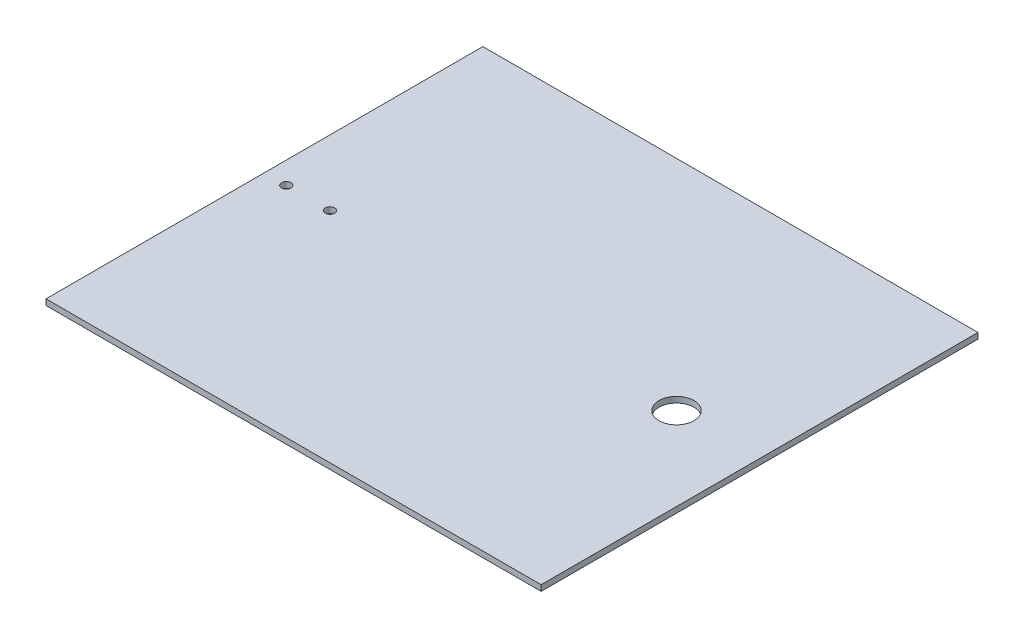
ISO-10303-21;
HEADER;
FILE_DESCRIPTION(('STEP AP214'),'2;1');
FILE_NAME('part.step','',(''),(''),'','','');
FILE_SCHEMA(('AUTOMOTIVE_DESIGN { 1 0 10303 214 1 1 1 1 }'));
ENDSEC;
DATA;
#1=APPLICATION_CONTEXT('core data for automotive mechanical design processes');
#2=APPLICATION_PROTOCOL_DEFINITION('international standard','automotive_design',2000,#1);
#3=PRODUCT_CONTEXT('',#1,'mechanical');
#4=PRODUCT('Part','Part','',(#3));
#5=PRODUCT_RELATED_PRODUCT_CATEGORY('part','',(#4));
#6=PRODUCT_DEFINITION_FORMATION('','',#4);
#7=PRODUCT_DEFINITION_CONTEXT('part definition',#1,'design');
#8=PRODUCT_DEFINITION('design','',#6,#7);
#9=PRODUCT_DEFINITION_SHAPE('','',#8);
#10=(LENGTH_UNIT() NAMED_UNIT(*) SI_UNIT(.MILLI.,.METRE.));
#11=(NAMED_UNIT(*) PLANE_ANGLE_UNIT() SI_UNIT($,.RADIAN.));
#12=(NAMED_UNIT(*) SI_UNIT($,.STERADIAN.) SOLID_ANGLE_UNIT());
#13=UNCERTAINTY_MEASURE_WITH_UNIT(LENGTH_MEASURE(1.E-05),#10,'distance_accuracy_value','');
#14=(GEOMETRIC_REPRESENTATION_CONTEXT(3) GLOBAL_UNCERTAINTY_ASSIGNED_CONTEXT((#13)) GLOBAL_UNIT_ASSIGNED_CONTEXT((#10,
#11,#12)) REPRESENTATION_CONTEXT('',''));
#15=CARTESIAN_POINT('',(0.,0.,0.));
#16=DIRECTION('',(0.,0.,1.));
#17=DIRECTION('',(1.,0.,0.));
#18=AXIS2_PLACEMENT_3D('',#15,#16,#17);
#19=CARTESIAN_POINT('',(85.,-2.,150.));
#20=DIRECTION('',(-1.,0.,0.));
#21=DIRECTION('',(0.,0.,1.));
#22=AXIS2_PLACEMENT_3D('',#19,#20,#21);
#23=PLANE('',#22);
#24=DIRECTION('',(0.,1.,0.));
#25=VECTOR('',#24,1.);
#26=CARTESIAN_POINT('',(85.,-2.,0.));
#27=LINE('',#26,#25);
#28=CARTESIAN_POINT('',(85.,-2.,0.));
#29=VERTEX_POINT('',#28);
#30=CARTESIAN_POINT('',(85.,0.,0.));
#31=VERTEX_POINT('',#30);
#32=EDGE_CURVE('E100',#29,#31,#27,.T.);
#33=ORIENTED_EDGE('',*,*,#32,.T.);
#34=DIRECTION('',(0.,0.,-1.));
#35=VECTOR('',#34,1.);
#36=CARTESIAN_POINT('',(85.,0.,150.));
#37=LINE('',#36,#35);
#38=CARTESIAN_POINT('',(85.,0.,150.));
#39=VERTEX_POINT('',#38);
#40=EDGE_CURVE('E11',#39,#31,#37,.T.);
#41=ORIENTED_EDGE('',*,*,#40,.F.);
#42=DIRECTION('',(0.,1.,0.));
#43=VECTOR('',#42,1.);
#44=CARTESIAN_POINT('',(85.,-2.,150.));
#45=LINE('',#44,#43);
#46=CARTESIAN_POINT('',(85.,-2.,150.));
#47=VERTEX_POINT('',#46);
#48=EDGE_CURVE('E85',#47,#39,#45,.T.);
#49=ORIENTED_EDGE('',*,*,#48,.F.);
#50=DIRECTION('',(0.,0.,-1.));
#51=VECTOR('',#50,1.);
#52=CARTESIAN_POINT('',(85.,-2.,150.));
#53=LINE('',#52,#51);
#54=EDGE_CURVE('E96',#47,#29,#53,.T.);
#55=ORIENTED_EDGE('',*,*,#54,.T.);
#56=EDGE_LOOP('',(#33,#41,#49,#55));
#57=FACE_BOUND('',#56,.T.);
#58=ADVANCED_FACE('F33',(#57),#23,.F.);
#59=CARTESIAN_POINT('',(0.,0.,150.));
#60=DIRECTION('',(0.,-1.,0.));
#61=DIRECTION('',(1.,0.,0.));
#62=AXIS2_PLACEMENT_3D('',#59,#60,#61);
#63=PLANE('',#62);
#64=CARTESIAN_POINT('',(56.4851578748345,0.,75.));
#65=DIRECTION('',(0.,1.,0.));
#66=DIRECTION('',(0.,0.,1.));
#67=AXIS2_PLACEMENT_3D('',#64,#65,#66);
#68=CIRCLE('',#67,6.);
#69=CARTESIAN_POINT('',(56.4851578748345,0.,81.));
#70=VERTEX_POINT('',#69);
#71=EDGE_CURVE('E124',#70,#70,#68,.T.);
#72=ORIENTED_EDGE('',*,*,#71,.F.);
#73=EDGE_LOOP('',(#72));
#74=FACE_BOUND('',#73,.T.);
#75=CARTESIAN_POINT('',(-62.5,0.,75.));
#76=DIRECTION('',(0.,1.,0.));
#77=DIRECTION('',(0.,0.,1.));
#78=AXIS2_PLACEMENT_3D('',#75,#76,#77);
#79=CIRCLE('',#78,1.6);
#80=CARTESIAN_POINT('',(-62.5,0.,76.6));
#81=VERTEX_POINT('',#80);
#82=EDGE_CURVE('E114',#81,#81,#79,.T.);
#83=ORIENTED_EDGE('',*,*,#82,.F.);
#84=EDGE_LOOP('',(#83));
#85=FACE_BOUND('',#84,.T.);
#86=CARTESIAN_POINT('',(-77.5,0.,75.));
#87=DIRECTION('',(0.,1.,0.));
#88=DIRECTION('',(0.,0.,1.));
#89=AXIS2_PLACEMENT_3D('',#86,#87,#88);
#90=CIRCLE('',#89,1.60000000000001);
#91=CARTESIAN_POINT('',(-77.5,0.,76.6));
#92=VERTEX_POINT('',#91);
#93=EDGE_CURVE('E111',#92,#92,#90,.T.);
#94=ORIENTED_EDGE('',*,*,#93,.F.);
#95=EDGE_LOOP('',(#94));
#96=FACE_BOUND('',#95,.T.);
#97=DIRECTION('',(-1.,0.,0.));
#98=VECTOR('',#97,1.);
#99=CARTESIAN_POINT('',(0.,0.,0.));
#100=LINE('',#99,#98);
#101=CARTESIAN_POINT('',(-85.,0.,0.));
#102=VERTEX_POINT('',#101);
#103=EDGE_CURVE('E90',#31,#102,#100,.T.);
#104=ORIENTED_EDGE('',*,*,#103,.T.);
#105=DIRECTION('',(0.,0.,-1.));
#106=VECTOR('',#105,1.);
#107=CARTESIAN_POINT('',(-85.,0.,150.));
#108=LINE('',#107,#106);
#109=CARTESIAN_POINT('',(-85.,0.,150.));
#110=VERTEX_POINT('',#109);
#111=EDGE_CURVE('E42',#110,#102,#108,.T.);
#112=ORIENTED_EDGE('',*,*,#111,.F.);
#113=DIRECTION('',(-1.,0.,0.));
#114=VECTOR('',#113,1.);
#115=CARTESIAN_POINT('',(0.,0.,150.));
#116=LINE('',#115,#114);
#117=EDGE_CURVE('E79',#39,#110,#116,.T.);
#118=ORIENTED_EDGE('',*,*,#117,.F.);
#119=ORIENTED_EDGE('',*,*,#40,.T.);
#120=EDGE_LOOP('',(#104,#112,#118,#119));
#121=FACE_BOUND('',#120,.T.);
#122=ADVANCED_FACE('F89',(#74,#85,#96,#121),#63,.F.);
#123=CARTESIAN_POINT('',(-85.,0.,150.));
#124=DIRECTION('',(1.,0.,0.));
#125=DIRECTION('',(0.,0.,-1.));
#126=AXIS2_PLACEMENT_3D('',#123,#124,#125);
#127=PLANE('',#126);
#128=DIRECTION('',(0.,-1.,0.));
#129=VECTOR('',#128,1.);
#130=CARTESIAN_POINT('',(-85.,0.,0.));
#131=LINE('',#130,#129);
#132=CARTESIAN_POINT('',(-85.,-2.,0.));
#133=VERTEX_POINT('',#132);
#134=EDGE_CURVE('E105',#102,#133,#131,.T.);
#135=ORIENTED_EDGE('',*,*,#134,.T.);
#136=DIRECTION('',(0.,0.,-1.));
#137=VECTOR('',#136,1.);
#138=CARTESIAN_POINT('',(-85.,-2.,150.));
#139=LINE('',#138,#137);
#140=CARTESIAN_POINT('',(-85.,-2.,150.));
#141=VERTEX_POINT('',#140);
#142=EDGE_CURVE('E92',#141,#133,#139,.T.);
#143=ORIENTED_EDGE('',*,*,#142,.F.);
#144=DIRECTION('',(0.,-1.,0.));
#145=VECTOR('',#144,1.);
#146=CARTESIAN_POINT('',(-85.,0.,150.));
#147=LINE('',#146,#145);
#148=EDGE_CURVE('E82',#110,#141,#147,.T.);
#149=ORIENTED_EDGE('',*,*,#148,.F.);
#150=ORIENTED_EDGE('',*,*,#111,.T.);
#151=EDGE_LOOP('',(#135,#143,#149,#150));
#152=FACE_BOUND('',#151,.T.);
#153=ADVANCED_FACE('F94',(#152),#127,.F.);
#154=CARTESIAN_POINT('',(0.,-2.,150.));
#155=DIRECTION('',(0.,1.,0.));
#156=DIRECTION('',(-1.,0.,0.));
#157=AXIS2_PLACEMENT_3D('',#154,#155,#156);
#158=PLANE('',#157);
#159=CARTESIAN_POINT('',(56.4851578748345,-2.,75.));
#160=DIRECTION('',(0.,1.,0.));
#161=DIRECTION('',(-1.,0.,0.));
#162=AXIS2_PLACEMENT_3D('',#159,#160,#161);
#163=CIRCLE('',#162,6.);
#164=CARTESIAN_POINT('',(50.4851578748345,-2.,75.));
#165=VERTEX_POINT('',#164);
#166=EDGE_CURVE('E36',#165,#165,#163,.T.);
#167=ORIENTED_EDGE('',*,*,#166,.T.);
#168=EDGE_LOOP('',(#167));
#169=FACE_BOUND('',#168,.T.);
#170=CARTESIAN_POINT('',(-62.5,-2.,75.));
#171=DIRECTION('',(0.,1.,0.));
#172=DIRECTION('',(-1.,0.,0.));
#173=AXIS2_PLACEMENT_3D('',#170,#171,#172);
#174=CIRCLE('',#173,1.6);
#175=CARTESIAN_POINT('',(-64.1,-2.,75.));
#176=VERTEX_POINT('',#175);
#177=EDGE_CURVE('E112',#176,#176,#174,.T.);
#178=ORIENTED_EDGE('',*,*,#177,.T.);
#179=EDGE_LOOP('',(#178));
#180=FACE_BOUND('',#179,.T.);
#181=CARTESIAN_POINT('',(-77.5,-2.,75.));
#182=DIRECTION('',(0.,1.,0.));
#183=DIRECTION('',(-1.,0.,0.));
#184=AXIS2_PLACEMENT_3D('',#181,#182,#183);
#185=CIRCLE('',#184,1.60000000000001);
#186=CARTESIAN_POINT('',(-79.1,-2.,75.));
#187=VERTEX_POINT('',#186);
#188=EDGE_CURVE('E103',#187,#187,#185,.T.);
#189=ORIENTED_EDGE('',*,*,#188,.T.);
#190=EDGE_LOOP('',(#189));
#191=FACE_BOUND('',#190,.T.);
#192=DIRECTION('',(1.,0.,0.));
#193=VECTOR('',#192,1.);
#194=CARTESIAN_POINT('',(0.,-2.,0.));
#195=LINE('',#194,#193);
#196=EDGE_CURVE('E68',#133,#29,#195,.T.);
#197=ORIENTED_EDGE('',*,*,#196,.T.);
#198=ORIENTED_EDGE('',*,*,#54,.F.);
#199=DIRECTION('',(1.,0.,0.));
#200=VECTOR('',#199,1.);
#201=CARTESIAN_POINT('',(0.,-2.,150.));
#202=LINE('',#201,#200);
#203=EDGE_CURVE('E51',#141,#47,#202,.T.);
#204=ORIENTED_EDGE('',*,*,#203,.F.);
#205=ORIENTED_EDGE('',*,*,#142,.T.);
#206=EDGE_LOOP('',(#197,#198,#204,#205));
#207=FACE_BOUND('',#206,.T.);
#208=ADVANCED_FACE('F145',(#169,#180,#191,#207),#158,.F.);
#209=CARTESIAN_POINT('',(0.,0.,150.));
#210=DIRECTION('',(0.,0.,-1.));
#211=DIRECTION('',(-1.,0.,0.));
#212=AXIS2_PLACEMENT_3D('',#209,#210,#211);
#213=PLANE('',#212);
#214=ORIENTED_EDGE('',*,*,#48,.T.);
#215=ORIENTED_EDGE('',*,*,#117,.T.);
#216=ORIENTED_EDGE('',*,*,#148,.T.);
#217=ORIENTED_EDGE('',*,*,#203,.T.);
#218=EDGE_LOOP('',(#214,#215,#216,#217));
#219=FACE_BOUND('',#218,.T.);
#220=ADVANCED_FACE('F80',(#219),#213,.F.);
#221=CARTESIAN_POINT('',(0.,0.,0.));
#222=DIRECTION('',(0.,0.,-1.));
#223=DIRECTION('',(-1.,0.,0.));
#224=AXIS2_PLACEMENT_3D('',#221,#222,#223);
#225=PLANE('',#224);
#226=ORIENTED_EDGE('',*,*,#32,.F.);
#227=ORIENTED_EDGE('',*,*,#196,.F.);
#228=ORIENTED_EDGE('',*,*,#134,.F.);
#229=ORIENTED_EDGE('',*,*,#103,.F.);
#230=EDGE_LOOP('',(#226,#227,#228,#229));
#231=FACE_BOUND('',#230,.T.);
#232=ADVANCED_FACE('F141',(#231),#225,.T.);
#233=CARTESIAN_POINT('',(-77.5,-10.,75.));
#234=DIRECTION('',(0.,1.,0.));
#235=DIRECTION('',(0.,0.,1.));
#236=AXIS2_PLACEMENT_3D('',#233,#234,#235);
#237=CYLINDRICAL_SURFACE('',#236,1.60000000000001);
#238=ORIENTED_EDGE('',*,*,#93,.T.);
#239=EDGE_LOOP('',(#238));
#240=FACE_BOUND('',#239,.T.);
#241=ORIENTED_EDGE('',*,*,#188,.F.);
#242=EDGE_LOOP('',(#241));
#243=FACE_BOUND('',#242,.T.);
#244=ADVANCED_FACE('F137',(#240,#243),#237,.F.);
#245=CARTESIAN_POINT('',(-62.5,-10.,75.));
#246=DIRECTION('',(0.,1.,0.));
#247=DIRECTION('',(0.,0.,1.));
#248=AXIS2_PLACEMENT_3D('',#245,#246,#247);
#249=CYLINDRICAL_SURFACE('',#248,1.6);
#250=ORIENTED_EDGE('',*,*,#82,.T.);
#251=EDGE_LOOP('',(#250));
#252=FACE_BOUND('',#251,.T.);
#253=ORIENTED_EDGE('',*,*,#177,.F.);
#254=EDGE_LOOP('',(#253));
#255=FACE_BOUND('',#254,.T.);
#256=ADVANCED_FACE('F140',(#252,#255),#249,.F.);
#257=CARTESIAN_POINT('',(56.4851578748345,-10.,75.));
#258=DIRECTION('',(0.,1.,0.));
#259=DIRECTION('',(0.,0.,1.));
#260=AXIS2_PLACEMENT_3D('',#257,#258,#259);
#261=CYLINDRICAL_SURFACE('',#260,6.);
#262=ORIENTED_EDGE('',*,*,#71,.T.);
#263=EDGE_LOOP('',(#262));
#264=FACE_BOUND('',#263,.T.);
#265=ORIENTED_EDGE('',*,*,#166,.F.);
#266=EDGE_LOOP('',(#265));
#267=FACE_BOUND('',#266,.T.);
#268=ADVANCED_FACE('F129',(#264,#267),#261,.F.);
#269=CLOSED_SHELL('',(#58,#122,#153,#208,#220,#232,#244,#256,#268));
#270=MANIFOLD_SOLID_BREP('B2',#269);
#271=ADVANCED_BREP_SHAPE_REPRESENTATION('',(#18,#270),#14);
#272=SHAPE_DEFINITION_REPRESENTATION(#9,#271);
ENDSEC;
END-ISO-10303-21;
